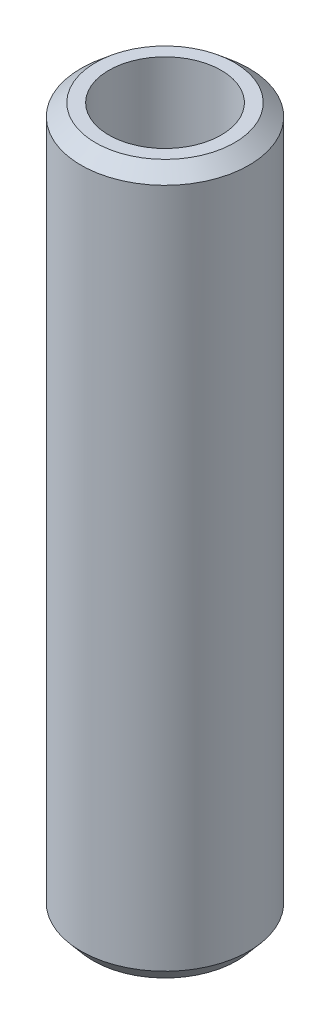
ISO-10303-21;
HEADER;
FILE_DESCRIPTION(('STEP AP214'),'2;1');
FILE_NAME('part.step','',(''),(''),'','','');
FILE_SCHEMA(('AUTOMOTIVE_DESIGN { 1 0 10303 214 1 1 1 1 }'));
ENDSEC;
DATA;
#1=APPLICATION_CONTEXT('core data for automotive mechanical design processes');
#2=APPLICATION_PROTOCOL_DEFINITION('international standard','automotive_design',2000,#1);
#3=PRODUCT_CONTEXT('',#1,'mechanical');
#4=PRODUCT('Part','Part','',(#3));
#5=PRODUCT_RELATED_PRODUCT_CATEGORY('part','',(#4));
#6=PRODUCT_DEFINITION_FORMATION('','',#4);
#7=PRODUCT_DEFINITION_CONTEXT('part definition',#1,'design');
#8=PRODUCT_DEFINITION('design','',#6,#7);
#9=PRODUCT_DEFINITION_SHAPE('','',#8);
#10=(LENGTH_UNIT() NAMED_UNIT(*) SI_UNIT(.MILLI.,.METRE.));
#11=(NAMED_UNIT(*) PLANE_ANGLE_UNIT() SI_UNIT($,.RADIAN.));
#12=(NAMED_UNIT(*) SI_UNIT($,.STERADIAN.) SOLID_ANGLE_UNIT());
#13=UNCERTAINTY_MEASURE_WITH_UNIT(LENGTH_MEASURE(1.E-05),#10,'distance_accuracy_value','');
#14=(GEOMETRIC_REPRESENTATION_CONTEXT(3) GLOBAL_UNCERTAINTY_ASSIGNED_CONTEXT((#13)) GLOBAL_UNIT_ASSIGNED_CONTEXT((#10,
#11,#12)) REPRESENTATION_CONTEXT('',''));
#15=CARTESIAN_POINT('',(0.,0.,0.));
#16=DIRECTION('',(0.,0.,1.));
#17=DIRECTION('',(1.,0.,0.));
#18=AXIS2_PLACEMENT_3D('',#15,#16,#17);
#19=CARTESIAN_POINT('',(0.,168.479880629981,0.));
#20=DIRECTION('',(0.,-1.,0.));
#21=DIRECTION('',(0.,0.,-1.));
#22=AXIS2_PLACEMENT_3D('',#19,#20,#21);
#23=CYLINDRICAL_SURFACE('',#22,20.);
#24=CARTESIAN_POINT('',(0.,165.567780862561,0.));
#25=DIRECTION('',(0.,1.,0.));
#26=DIRECTION('',(0.,0.,1.));
#27=AXIS2_PLACEMENT_3D('',#24,#25,#26);
#28=CIRCLE('',#27,20.);
#29=CARTESIAN_POINT('',(0.,165.567780862561,-20.));
#30=VERTEX_POINT('',#29);
#31=EDGE_CURVE('E50',#30,#30,#28,.F.);
#32=CARTESIAN_POINT('',(0.,3.45083204728305,0.));
#33=DIRECTION('',(0.,1.,0.));
#34=DIRECTION('',(0.,0.,1.));
#35=AXIS2_PLACEMENT_3D('',#32,#33,#34);
#36=CIRCLE('',#35,20.);
#37=CARTESIAN_POINT('',(0.,3.45083204728303,-20.));
#38=VERTEX_POINT('',#37);
#39=EDGE_CURVE('E51',#38,#38,#36,.T.);
#40=CARTESIAN_POINT('',(0.,165.567780862561,-20.));
#41=CARTESIAN_POINT('',(0.,163.879062645735,-20.));
#42=CARTESIAN_POINT('',(0.,162.190344428909,-20.));
#43=CARTESIAN_POINT('',(0.,158.812907995258,-20.));
#44=CARTESIAN_POINT('',(0.,157.124189778432,-20.));
#45=CARTESIAN_POINT('',(0.,153.74675334478,-20.));
#46=CARTESIAN_POINT('',(0.,152.058035127954,-20.));
#47=CARTESIAN_POINT('',(0.,148.680598694303,-20.));
#48=CARTESIAN_POINT('',(0.,146.991880477477,-20.));
#49=CARTESIAN_POINT('',(0.,143.614444043825,-20.));
#50=CARTESIAN_POINT('',(0.,141.925725827,-20.));
#51=CARTESIAN_POINT('',(0.,138.548289393348,-20.));
#52=CARTESIAN_POINT('',(0.,136.859571176522,-20.));
#53=CARTESIAN_POINT('',(0.,133.482134742871,-20.));
#54=CARTESIAN_POINT('',(0.,131.793416526045,-20.));
#55=CARTESIAN_POINT('',(0.,128.415980092393,-20.));
#56=CARTESIAN_POINT('',(0.,126.727261875567,-20.));
#57=CARTESIAN_POINT('',(0.,123.349825441916,-20.));
#58=CARTESIAN_POINT('',(0.,121.66110722509,-20.));
#59=CARTESIAN_POINT('',(0.,118.283670791438,-20.));
#60=CARTESIAN_POINT('',(0.,116.594952574612,-20.));
#61=CARTESIAN_POINT('',(0.,113.217516140961,-20.));
#62=CARTESIAN_POINT('',(0.,111.528797924135,-20.));
#63=CARTESIAN_POINT('',(0.,108.151361490483,-20.));
#64=CARTESIAN_POINT('',(0.,106.462643273658,-20.));
#65=CARTESIAN_POINT('',(0.,103.085206840006,-20.));
#66=CARTESIAN_POINT('',(0.,101.39648862318,-20.));
#67=CARTESIAN_POINT('',(0.,98.0190521895285,-20.));
#68=CARTESIAN_POINT('',(0.,96.3303339727027,-20.));
#69=CARTESIAN_POINT('',(0.,92.9528975390511,-20.));
#70=CARTESIAN_POINT('',(0.,91.2641793222252,-20.));
#71=CARTESIAN_POINT('',(0.,87.8867428885736,-20.));
#72=CARTESIAN_POINT('',(0.,86.1980246717478,-20.));
#73=CARTESIAN_POINT('',(0.,82.8205882380962,-20.));
#74=CARTESIAN_POINT('',(0.,81.1318700212704,-20.));
#75=CARTESIAN_POINT('',(0.,77.7544335876187,-20.));
#76=CARTESIAN_POINT('',(0.,76.0657153707929,-20.));
#77=CARTESIAN_POINT('',(0.,72.6882789371413,-20.));
#78=CARTESIAN_POINT('',(0.,70.9995607203155,-20.));
#79=CARTESIAN_POINT('',(0.,67.6221242866639,-20.));
#80=CARTESIAN_POINT('',(0.,65.9334060698381,-20.));
#81=CARTESIAN_POINT('',(0.,62.5559696361864,-20.));
#82=CARTESIAN_POINT('',(0.,60.8672514193606,-20.));
#83=CARTESIAN_POINT('',(0.,57.489814985709,-20.));
#84=CARTESIAN_POINT('',(0.,55.8010967688832,-20.));
#85=CARTESIAN_POINT('',(0.,52.4236603352316,-20.));
#86=CARTESIAN_POINT('',(0.,50.7349421184057,-20.));
#87=CARTESIAN_POINT('',(0.,47.3575056847541,-20.));
#88=CARTESIAN_POINT('',(0.,45.6687874679283,-20.));
#89=CARTESIAN_POINT('',(0.,42.2913510342767,-20.));
#90=CARTESIAN_POINT('',(0.,40.6026328174509,-20.));
#91=CARTESIAN_POINT('',(0.,37.2251963837993,-20.));
#92=CARTESIAN_POINT('',(0.,35.5364781669735,-20.));
#93=CARTESIAN_POINT('',(0.,32.1590417333218,-20.));
#94=CARTESIAN_POINT('',(0.,30.470323516496,-20.));
#95=CARTESIAN_POINT('',(0.,27.0928870828444,-20.));
#96=CARTESIAN_POINT('',(0.,25.4041688660186,-20.));
#97=CARTESIAN_POINT('',(0.,22.026732432367,-20.));
#98=CARTESIAN_POINT('',(0.,20.3380142155412,-20.));
#99=CARTESIAN_POINT('',(0.,16.9605777818895,-20.));
#100=CARTESIAN_POINT('',(0.,15.2718595650637,-20.));
#101=CARTESIAN_POINT('',(0.,11.8944231314121,-20.));
#102=CARTESIAN_POINT('',(0.,10.2057049145863,-20.));
#103=CARTESIAN_POINT('',(0.,6.82826848093465,-20.));
#104=CARTESIAN_POINT('',(0.,5.13955026410884,-20.));
#105=CARTESIAN_POINT('',(0.,3.45083204728303,-20.));
#106=B_SPLINE_CURVE_WITH_KNOTS('',3,(#40,#41,#42,#43,#44,#45,#46,#47,#48,#49,#50,#51,#52,#53,
#54,#55,#56,#57,#58,#59,#60,#61,#62,#63,#64,#65,#66,#67,#68,#69,#70,#71,#72,#73,#74,#75,#76,#77,
#78,#79,#80,#81,#82,#83,#84,#85,#86,#87,#88,#89,#90,#91,#92,#93,#94,#95,#96,#97,#98,#99,#100,
#101,#102,#103,#104,#105),.UNSPECIFIED.,.F.,.F.,(4,2,2,2,2,2,2,2,2,2,2,2,2,2,2,2,2,2,2,2,2,2,2,
2,2,2,2,2,2,2,2,2,4),(0.,5.06615465047744,10.1323093009549,15.1984639514323,20.2646186019098,
25.3307732523872,30.3969279028646,35.4630825533421,40.5292372038195,45.5953918542969,
50.6615465047744,55.7277011552518,60.7938558057293,65.8600104562067,70.9261651066841,
75.9923197571616,81.058474407639,86.1246290581164,91.1907837085939,96.2569383590713,
101.323093009549,106.389247660026,111.455402310504,116.521556960981,121.587711611459,
126.653866261936,131.720020912413,136.786175562891,141.852330213368,146.918484863846,
151.984639514323,157.050794164801,162.116948815278),.UNSPECIFIED.);
#107=EDGE_CURVE('BSEAM39',#30,#38,#106,.T.);
#108=ORIENTED_EDGE('',*,*,#31,.T.);
#109=ORIENTED_EDGE('',*,*,#39,.T.);
#110=ORIENTED_EDGE('',*,*,#107,.T.);
#111=ORIENTED_EDGE('',*,*,#107,.F.);
#112=EDGE_LOOP('',(#108,#110,#109,#111));
#113=FACE_BOUND('',#112,.T.);
#114=ADVANCED_FACE('F39',(#113),#23,.T.);
#115=CARTESIAN_POINT('',(0.,168.479880629981,0.));
#116=DIRECTION('',(0.,1.,0.));
#117=DIRECTION('',(0.,0.,1.));
#118=AXIS2_PLACEMENT_3D('',#115,#116,#117);
#119=PLANE('',#118);
#120=CARTESIAN_POINT('',(0.,168.479880629981,0.));
#121=DIRECTION('',(0.,1.,0.));
#122=DIRECTION('',(0.,0.,1.));
#123=AXIS2_PLACEMENT_3D('',#120,#121,#122);
#124=CIRCLE('',#123,16.5491679527173);
#125=CARTESIAN_POINT('',(0.,168.479880629981,-16.5491679527173));
#126=VERTEX_POINT('',#125);
#127=EDGE_CURVE('E54',#126,#126,#124,.T.);
#128=ORIENTED_EDGE('',*,*,#127,.T.);
#129=EDGE_LOOP('',(#128));
#130=FACE_BOUND('',#129,.T.);
#131=CARTESIAN_POINT('',(0.,168.479880629981,0.));
#132=DIRECTION('',(0.,1.,0.));
#133=DIRECTION('',(0.,0.,1.));
#134=AXIS2_PLACEMENT_3D('',#131,#132,#133);
#135=CIRCLE('',#134,13.3769302578967);
#136=CARTESIAN_POINT('',(0.,168.479880629981,-13.3769302578967));
#137=VERTEX_POINT('',#136);
#138=EDGE_CURVE('E58',#137,#137,#135,.T.);
#139=ORIENTED_EDGE('',*,*,#138,.F.);
#140=EDGE_LOOP('',(#139));
#141=FACE_BOUND('',#140,.T.);
#142=ADVANCED_FACE('F69',(#130,#141),#119,.T.);
#143=CARTESIAN_POINT('',(0.,0.,0.));
#144=DIRECTION('',(0.,1.,0.));
#145=DIRECTION('',(0.,0.,1.));
#146=AXIS2_PLACEMENT_3D('',#143,#144,#145);
#147=PLANE('',#146);
#148=CARTESIAN_POINT('',(0.,0.,0.));
#149=DIRECTION('',(0.,1.,0.));
#150=DIRECTION('',(0.,0.,1.));
#151=AXIS2_PLACEMENT_3D('',#148,#149,#150);
#152=CIRCLE('',#151,17.0879002325802);
#153=CARTESIAN_POINT('',(0.,0.,17.0879002325802));
#154=VERTEX_POINT('',#153);
#155=EDGE_CURVE('E10',#154,#154,#152,.F.);
#156=ORIENTED_EDGE('',*,*,#155,.T.);
#157=EDGE_LOOP('',(#156));
#158=FACE_BOUND('',#157,.T.);
#159=CARTESIAN_POINT('',(0.,0.,0.));
#160=DIRECTION('',(0.,1.,0.));
#161=DIRECTION('',(0.,0.,1.));
#162=AXIS2_PLACEMENT_3D('',#159,#160,#161);
#163=CIRCLE('',#162,13.3769302578967);
#164=CARTESIAN_POINT('',(0.,0.,-13.3769302578967));
#165=VERTEX_POINT('',#164);
#166=EDGE_CURVE('E63',#165,#165,#163,.T.);
#167=ORIENTED_EDGE('',*,*,#166,.T.);
#168=EDGE_LOOP('',(#167));
#169=FACE_BOUND('',#168,.T.);
#170=ADVANCED_FACE('F75',(#158,#169),#147,.F.);
#171=CARTESIAN_POINT('',(0.,168.479880629981,0.));
#172=DIRECTION('',(0.,-1.,0.));
#173=DIRECTION('',(0.,0.,-1.));
#174=AXIS2_PLACEMENT_3D('',#171,#172,#173);
#175=CYLINDRICAL_SURFACE('',#174,13.3769302578967);
#176=CARTESIAN_POINT('',(0.,168.479880629981,-13.3769302578967));
#177=CARTESIAN_POINT('',(0.,166.724881873418,-13.3769302578967));
#178=CARTESIAN_POINT('',(0.,164.969883116856,-13.3769302578967));
#179=CARTESIAN_POINT('',(0.,161.459885603731,-13.3769302578967));
#180=CARTESIAN_POINT('',(0.,159.704886847169,-13.3769302578967));
#181=CARTESIAN_POINT('',(0.,156.194889334044,-13.3769302578967));
#182=CARTESIAN_POINT('',(0.,154.439890577482,-13.3769302578967));
#183=CARTESIAN_POINT('',(0.,150.929893064358,-13.3769302578967));
#184=CARTESIAN_POINT('',(0.,149.174894307795,-13.3769302578967));
#185=CARTESIAN_POINT('',(0.,145.664896794671,-13.3769302578967));
#186=CARTESIAN_POINT('',(0.,143.909898038108,-13.3769302578967));
#187=CARTESIAN_POINT('',(0.,140.399900524984,-13.3769302578967));
#188=CARTESIAN_POINT('',(0.,138.644901768422,-13.3769302578967));
#189=CARTESIAN_POINT('',(0.,135.134904255297,-13.3769302578967));
#190=CARTESIAN_POINT('',(0.,133.379905498735,-13.3769302578967));
#191=CARTESIAN_POINT('',(0.,129.86990798561,-13.3769302578967));
#192=CARTESIAN_POINT('',(0.,128.114909229048,-13.3769302578967));
#193=CARTESIAN_POINT('',(0.,124.604911715923,-13.3769302578967));
#194=CARTESIAN_POINT('',(0.,122.849912959361,-13.3769302578967));
#195=CARTESIAN_POINT('',(0.,119.339915446236,-13.3769302578967));
#196=CARTESIAN_POINT('',(0.,117.584916689674,-13.3769302578967));
#197=CARTESIAN_POINT('',(0.,114.074919176549,-13.3769302578967));
#198=CARTESIAN_POINT('',(0.,112.319920419987,-13.3769302578967));
#199=CARTESIAN_POINT('',(0.,108.809922906862,-13.3769302578967));
#200=CARTESIAN_POINT('',(0.,107.0549241503,-13.3769302578967));
#201=CARTESIAN_POINT('',(0.,103.544926637176,-13.3769302578967));
#202=CARTESIAN_POINT('',(0.,101.789927880613,-13.3769302578967));
#203=CARTESIAN_POINT('',(0.,98.2799303674887,-13.3769302578967));
#204=CARTESIAN_POINT('',(0.,96.5249316109264,-13.3769302578967));
#205=CARTESIAN_POINT('',(0.,93.0149340978018,-13.3769302578967));
#206=CARTESIAN_POINT('',(0.,91.2599353412395,-13.3769302578967));
#207=CARTESIAN_POINT('',(0.,87.7499378281149,-13.3769302578967));
#208=CARTESIAN_POINT('',(0.,85.9949390715526,-13.3769302578967));
#209=CARTESIAN_POINT('',(0.,82.484941558428,-13.3769302578967));
#210=CARTESIAN_POINT('',(0.,80.7299428018657,-13.3769302578967));
#211=CARTESIAN_POINT('',(0.,77.2199452887411,-13.3769302578967));
#212=CARTESIAN_POINT('',(0.,75.4649465321788,-13.3769302578967));
#213=CARTESIAN_POINT('',(0.,71.9549490190542,-13.3769302578967));
#214=CARTESIAN_POINT('',(0.,70.1999502624919,-13.3769302578967));
#215=CARTESIAN_POINT('',(0.,66.6899527493673,-13.3769302578967));
#216=CARTESIAN_POINT('',(0.,64.934953992805,-13.3769302578967));
#217=CARTESIAN_POINT('',(0.,61.4249564796804,-13.3769302578967));
#218=CARTESIAN_POINT('',(0.,59.6699577231181,-13.3769302578967));
#219=CARTESIAN_POINT('',(0.,56.1599602099935,-13.3769302578967));
#220=CARTESIAN_POINT('',(0.,54.4049614534312,-13.3769302578967));
#221=CARTESIAN_POINT('',(0.,50.8949639403066,-13.3769302578967));
#222=CARTESIAN_POINT('',(0.,49.1399651837443,-13.3769302578967));
#223=CARTESIAN_POINT('',(0.,45.6299676706197,-13.3769302578967));
#224=CARTESIAN_POINT('',(0.,43.8749689140574,-13.3769302578967));
#225=CARTESIAN_POINT('',(0.,40.3649714009328,-13.3769302578967));
#226=CARTESIAN_POINT('',(0.,38.6099726443706,-13.3769302578967));
#227=CARTESIAN_POINT('',(0.,35.099975131246,-13.3769302578967));
#228=CARTESIAN_POINT('',(0.,33.3449763746837,-13.3769302578967));
#229=CARTESIAN_POINT('',(0.,29.8349788615591,-13.3769302578967));
#230=CARTESIAN_POINT('',(0.,28.0799801049968,-13.3769302578967));
#231=CARTESIAN_POINT('',(0.,24.5699825918722,-13.3769302578967));
#232=CARTESIAN_POINT('',(0.,22.8149838353099,-13.3769302578967));
#233=CARTESIAN_POINT('',(0.,19.3049863221853,-13.3769302578967));
#234=CARTESIAN_POINT('',(0.,17.549987565623,-13.3769302578967));
#235=CARTESIAN_POINT('',(0.,14.0399900524984,-13.3769302578967));
#236=CARTESIAN_POINT('',(0.,12.2849912959361,-13.3769302578967));
#237=CARTESIAN_POINT('',(0.,8.77499378281149,-13.3769302578967));
#238=CARTESIAN_POINT('',(0.,7.0199950262492,-13.3769302578967));
#239=CARTESIAN_POINT('',(0.,3.5099975131246,-13.3769302578967));
#240=CARTESIAN_POINT('',(0.,1.7549987565623,-13.3769302578967));
#241=CARTESIAN_POINT('',(0.,0.,-13.3769302578967));
#242=B_SPLINE_CURVE_WITH_KNOTS('',3,(#176,#177,#178,#179,#180,#181,#182,#183,#184,#185,#186,
#187,#188,#189,#190,#191,#192,#193,#194,#195,#196,#197,#198,#199,#200,#201,#202,#203,#204,#205,
#206,#207,#208,#209,#210,#211,#212,#213,#214,#215,#216,#217,#218,#219,#220,#221,#222,#223,#224,
#225,#226,#227,#228,#229,#230,#231,#232,#233,#234,#235,#236,#237,#238,#239,#240,#241),
.UNSPECIFIED.,.F.,.F.,(4,2,2,2,2,2,2,2,2,2,2,2,2,2,2,2,2,2,2,2,2,2,2,2,2,2,2,2,2,2,2,2,4),(0.,
5.26499626968688,10.5299925393738,15.7949888090607,21.0599850787476,26.3249813484344,
31.5899776181213,36.8549738878082,42.1199701574951,47.384966427182,52.6499626968689,
57.9149589665558,63.1799552362427,68.4449515059296,73.7099477756165,78.9749440453034,
84.2399403149902,89.5049365846772,94.769932854364,100.034929124051,105.299925393738,
110.564921663425,115.829917933112,121.094914202798,126.359910472485,131.624906742172,
136.889903011859,142.154899281546,147.419895551233,152.68489182092,157.949888090607,
163.214884360294,168.479880629981),.UNSPECIFIED.);
#243=EDGE_CURVE('BSEAM70',#137,#165,#242,.T.);
#244=ORIENTED_EDGE('',*,*,#138,.T.);
#245=ORIENTED_EDGE('',*,*,#166,.F.);
#246=ORIENTED_EDGE('',*,*,#243,.T.);
#247=ORIENTED_EDGE('',*,*,#243,.F.);
#248=EDGE_LOOP('',(#244,#246,#245,#247));
#249=FACE_BOUND('',#248,.T.);
#250=ADVANCED_FACE('F70',(#249),#175,.F.);
#251=CARTESIAN_POINT('',(0.,168.479880629981,0.));
#252=DIRECTION('',(0.,-1.,0.));
#253=DIRECTION('',(0.,0.,-1.));
#254=AXIS2_PLACEMENT_3D('',#251,#252,#253);
#255=CONICAL_SURFACE('',#254,16.5491679527173,0.869864018766601);
#256=CARTESIAN_POINT('',(0.,165.567780862561,-20.));
#257=CARTESIAN_POINT('',(0.,165.598115235138,-19.9640538328408));
#258=CARTESIAN_POINT('',(0.,165.628449607716,-19.9281076656816));
#259=CARTESIAN_POINT('',(0.,165.68911835287,-19.8562153313632));
#260=CARTESIAN_POINT('',(0.,165.719452725447,-19.820269164204));
#261=CARTESIAN_POINT('',(0.,165.780121470602,-19.7483768298857));
#262=CARTESIAN_POINT('',(0.,165.810455843179,-19.7124306627265));
#263=CARTESIAN_POINT('',(0.,165.871124588334,-19.6405383284081));
#264=CARTESIAN_POINT('',(0.,165.901458960911,-19.6045921612489));
#265=CARTESIAN_POINT('',(0.,165.962127706066,-19.5326998269305));
#266=CARTESIAN_POINT('',(0.,165.992462078643,-19.4967536597713));
#267=CARTESIAN_POINT('',(0.,166.053130823798,-19.4248613254529));
#268=CARTESIAN_POINT('',(0.,166.083465196375,-19.3889151582937));
#269=CARTESIAN_POINT('',(0.,166.144133941529,-19.3170228239753));
#270=CARTESIAN_POINT('',(0.,166.174468314107,-19.2810766568161));
#271=CARTESIAN_POINT('',(0.,166.235137059261,-19.2091843224977));
#272=CARTESIAN_POINT('',(0.,166.265471431839,-19.1732381553385));
#273=CARTESIAN_POINT('',(0.,166.326140176993,-19.1013458210201));
#274=CARTESIAN_POINT('',(0.,166.35647454957,-19.0653996538609));
#275=CARTESIAN_POINT('',(0.,166.417143294725,-18.9935073195426));
#276=CARTESIAN_POINT('',(0.,166.447477667302,-18.9575611523834));
#277=CARTESIAN_POINT('',(0.,166.508146412457,-18.885668818065));
#278=CARTESIAN_POINT('',(0.,166.538480785034,-18.8497226509058));
#279=CARTESIAN_POINT('',(0.,166.599149530189,-18.7778303165874));
#280=CARTESIAN_POINT('',(0.,166.629483902766,-18.7418841494282));
#281=CARTESIAN_POINT('',(0.,166.690152647921,-18.6699918151098));
#282=CARTESIAN_POINT('',(0.,166.720487020498,-18.6340456479506));
#283=CARTESIAN_POINT('',(0.,166.781155765652,-18.5621533136322));
#284=CARTESIAN_POINT('',(0.,166.81149013823,-18.526207146473));
#285=CARTESIAN_POINT('',(0.,166.872158883384,-18.4543148121546));
#286=CARTESIAN_POINT('',(0.,166.902493255962,-18.4183686449954));
#287=CARTESIAN_POINT('',(0.,166.963162001116,-18.346476310677));
#288=CARTESIAN_POINT('',(0.,166.993496373693,-18.3105301435178));
#289=CARTESIAN_POINT('',(0.,167.054165118848,-18.2386378091995));
#290=CARTESIAN_POINT('',(0.,167.084499491425,-18.2026916420403));
#291=CARTESIAN_POINT('',(0.,167.14516823658,-18.1307993077219));
#292=CARTESIAN_POINT('',(0.,167.175502609157,-18.0948531405627));
#293=CARTESIAN_POINT('',(0.,167.236171354312,-18.0229608062443));
#294=CARTESIAN_POINT('',(0.,167.266505726889,-17.9870146390851));
#295=CARTESIAN_POINT('',(0.,167.327174472044,-17.9151223047667));
#296=CARTESIAN_POINT('',(0.,167.357508844621,-17.8791761376075));
#297=CARTESIAN_POINT('',(0.,167.418177589775,-17.8072838032891));
#298=CARTESIAN_POINT('',(0.,167.448511962353,-17.7713376361299));
#299=CARTESIAN_POINT('',(0.,167.509180707507,-17.6994453018115));
#300=CARTESIAN_POINT('',(0.,167.539515080085,-17.6634991346523));
#301=CARTESIAN_POINT('',(0.,167.600183825239,-17.5916068003339));
#302=CARTESIAN_POINT('',(0.,167.630518197816,-17.5556606331747));
#303=CARTESIAN_POINT('',(0.,167.691186942971,-17.4837682988564));
#304=CARTESIAN_POINT('',(0.,167.721521315548,-17.4478221316972));
#305=CARTESIAN_POINT('',(0.,167.782190060703,-17.3759297973788));
#306=CARTESIAN_POINT('',(0.,167.81252443328,-17.3399836302196));
#307=CARTESIAN_POINT('',(0.,167.873193178435,-17.2680912959012));
#308=CARTESIAN_POINT('',(0.,167.903527551012,-17.232145128742));
#309=CARTESIAN_POINT('',(0.,167.964196296167,-17.1602527944236));
#310=CARTESIAN_POINT('',(0.,167.994530668744,-17.1243066272644));
#311=CARTESIAN_POINT('',(0.,168.055199413899,-17.052414292946));
#312=CARTESIAN_POINT('',(0.,168.085533786476,-17.0164681257868));
#313=CARTESIAN_POINT('',(0.,168.14620253163,-16.9445757914684));
#314=CARTESIAN_POINT('',(0.,168.176536904208,-16.9086296243092));
#315=CARTESIAN_POINT('',(0.,168.237205649362,-16.8367372899908));
#316=CARTESIAN_POINT('',(0.,168.26754002194,-16.8007911228316));
#317=CARTESIAN_POINT('',(0.,168.328208767094,-16.7288987885133));
#318=CARTESIAN_POINT('',(0.,168.358543139671,-16.6929526213541));
#319=CARTESIAN_POINT('',(0.,168.419211884826,-16.6210602870357));
#320=CARTESIAN_POINT('',(0.,168.449546257403,-16.5851141198765));
#321=CARTESIAN_POINT('',(0.,168.479880629981,-16.5491679527173));
#322=B_SPLINE_CURVE_WITH_KNOTS('',3,(#256,#257,#258,#259,#260,#261,#262,#263,#264,#265,#266,
#267,#268,#269,#270,#271,#272,#273,#274,#275,#276,#277,#278,#279,#280,#281,#282,#283,#284,#285,
#286,#287,#288,#289,#290,#291,#292,#293,#294,#295,#296,#297,#298,#299,#300,#301,#302,#303,#304,
#305,#306,#307,#308,#309,#310,#311,#312,#313,#314,#315,#316,#317,#318,#319,#320,#321),
.UNSPECIFIED.,.F.,.F.,(4,2,2,2,2,2,2,2,2,2,2,2,2,2,2,2,2,2,2,2,2,2,2,2,2,2,2,2,2,2,2,2,4),(0.,
0.141105314704479,0.282210629408956,0.423315944113432,0.564421258817911,0.705526573522388,
0.846631888226867,0.987737202931344,1.12884251763584,1.26994783234032,1.41105314704479,
1.55215846174927,1.69326377645375,1.83436909115823,1.97547440586271,2.11657972056718,
2.25768503527168,2.39879034997616,2.53989566468063,2.68100097938511,2.82210629408959,
2.96321160879406,3.10431692349854,3.24542223820302,3.38652755290752,3.52763286761199,
3.66873818231647,3.80984349702095,3.95094881172543,4.0920541264299,4.23315944113438,
4.37426475583886,4.51537007054335),.UNSPECIFIED.);
#323=EDGE_CURVE('BSEAM81',#30,#126,#322,.T.);
#324=ORIENTED_EDGE('',*,*,#31,.F.);
#325=ORIENTED_EDGE('',*,*,#127,.F.);
#326=ORIENTED_EDGE('',*,*,#323,.T.);
#327=ORIENTED_EDGE('',*,*,#323,.F.);
#328=EDGE_LOOP('',(#324,#326,#325,#327));
#329=FACE_BOUND('',#328,.T.);
#330=ADVANCED_FACE('F81',(#329),#255,.T.);
#331=CARTESIAN_POINT('',(0.,3.45083204728303,0.));
#332=DIRECTION('',(0.,1.,0.));
#333=DIRECTION('',(0.,0.,1.));
#334=AXIS2_PLACEMENT_3D('',#331,#332,#333);
#335=CONICAL_SURFACE('',#334,20.,0.700932308028292);
#336=ORIENTED_EDGE('',*,*,#155,.F.);
#337=EDGE_LOOP('',(#336));
#338=FACE_BOUND('',#337,.T.);
#339=ORIENTED_EDGE('',*,*,#39,.F.);
#340=EDGE_LOOP('',(#339));
#341=FACE_BOUND('',#340,.T.);
#342=ADVANCED_FACE('F45',(#338,#341),#335,.T.);
#343=CLOSED_SHELL('',(#114,#142,#170,#250,#330,#342));
#344=MANIFOLD_SOLID_BREP('B2',#343);
#345=ADVANCED_BREP_SHAPE_REPRESENTATION('',(#18,#344),#14);
#346=SHAPE_DEFINITION_REPRESENTATION(#9,#345);
ENDSEC;
END-ISO-10303-21;
